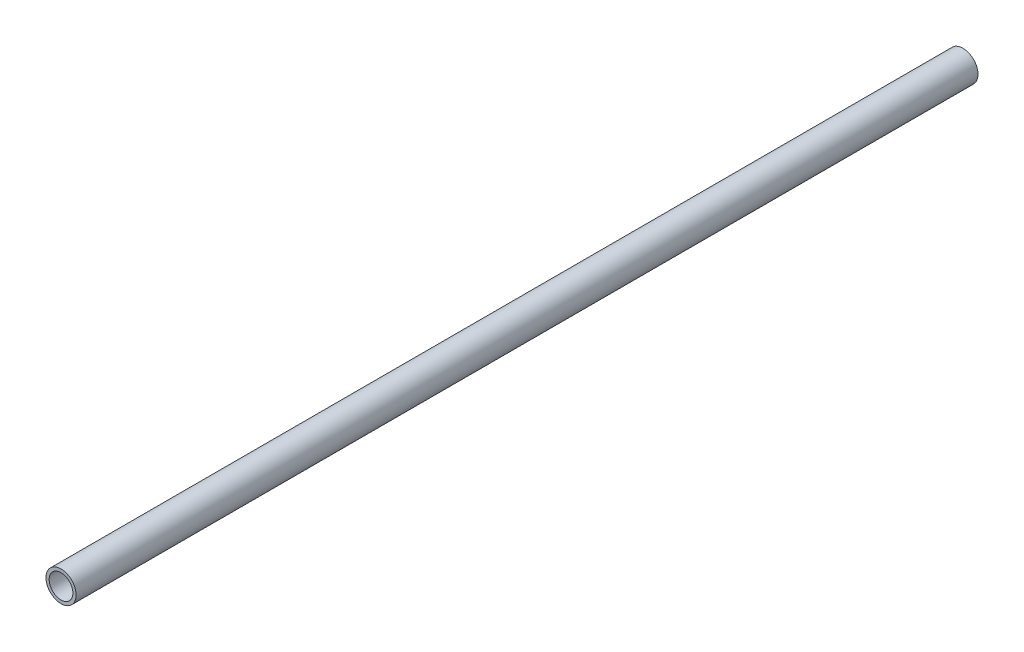
ISO-10303-21;
HEADER;
FILE_DESCRIPTION(('STEP AP214'),'2;1');
FILE_NAME('part.step','',(''),(''),'','','');
FILE_SCHEMA(('AUTOMOTIVE_DESIGN { 1 0 10303 214 1 1 1 1 }'));
ENDSEC;
DATA;
#1=APPLICATION_CONTEXT('core data for automotive mechanical design processes');
#2=APPLICATION_PROTOCOL_DEFINITION('international standard','automotive_design',2000,#1);
#3=PRODUCT_CONTEXT('',#1,'mechanical');
#4=PRODUCT('Part','Part','',(#3));
#5=PRODUCT_RELATED_PRODUCT_CATEGORY('part','',(#4));
#6=PRODUCT_DEFINITION_FORMATION('','',#4);
#7=PRODUCT_DEFINITION_CONTEXT('part definition',#1,'design');
#8=PRODUCT_DEFINITION('design','',#6,#7);
#9=PRODUCT_DEFINITION_SHAPE('','',#8);
#10=(LENGTH_UNIT() NAMED_UNIT(*) SI_UNIT(.MILLI.,.METRE.));
#11=(NAMED_UNIT(*) PLANE_ANGLE_UNIT() SI_UNIT($,.RADIAN.));
#12=(NAMED_UNIT(*) SI_UNIT($,.STERADIAN.) SOLID_ANGLE_UNIT());
#13=UNCERTAINTY_MEASURE_WITH_UNIT(LENGTH_MEASURE(1.E-05),#10,'distance_accuracy_value','');
#14=(GEOMETRIC_REPRESENTATION_CONTEXT(3) GLOBAL_UNCERTAINTY_ASSIGNED_CONTEXT((#13)) GLOBAL_UNIT_ASSIGNED_CONTEXT((#10,
#11,#12)) REPRESENTATION_CONTEXT('',''));
#15=CARTESIAN_POINT('',(0.,0.,0.));
#16=DIRECTION('',(0.,0.,1.));
#17=DIRECTION('',(1.,0.,0.));
#18=AXIS2_PLACEMENT_3D('',#15,#16,#17);
#19=CARTESIAN_POINT('',(0.,0.,380.28));
#20=DIRECTION('',(0.,0.,1.));
#21=DIRECTION('',(1.,0.,0.));
#22=AXIS2_PLACEMENT_3D('',#19,#20,#21);
#23=PLANE('',#22);
#24=CARTESIAN_POINT('',(0.,0.,380.28));
#25=DIRECTION('',(0.,0.,1.));
#26=DIRECTION('',(1.,0.,0.));
#27=AXIS2_PLACEMENT_3D('',#24,#25,#26);
#28=CIRCLE('',#27,6.35);
#29=CARTESIAN_POINT('',(6.35,0.,380.28));
#30=VERTEX_POINT('',#29);
#31=EDGE_CURVE('E10',#30,#30,#28,.T.);
#32=ORIENTED_EDGE('',*,*,#31,.T.);
#33=EDGE_LOOP('',(#32));
#34=FACE_BOUND('',#33,.T.);
#35=CARTESIAN_POINT('',(0.,0.,380.28));
#36=DIRECTION('',(0.,0.,1.));
#37=DIRECTION('',(1.,0.,0.));
#38=AXIS2_PLACEMENT_3D('',#35,#36,#37);
#39=CIRCLE('',#38,5.);
#40=CARTESIAN_POINT('',(5.,0.,380.28));
#41=VERTEX_POINT('',#40);
#42=EDGE_CURVE('E43',#41,#41,#39,.T.);
#43=ORIENTED_EDGE('',*,*,#42,.F.);
#44=EDGE_LOOP('',(#43));
#45=FACE_BOUND('',#44,.T.);
#46=ADVANCED_FACE('F32',(#34,#45),#23,.T.);
#47=CARTESIAN_POINT('',(0.,0.,0.));
#48=DIRECTION('',(0.,0.,1.));
#49=DIRECTION('',(1.,0.,0.));
#50=AXIS2_PLACEMENT_3D('',#47,#48,#49);
#51=PLANE('',#50);
#52=CARTESIAN_POINT('',(0.,0.,0.));
#53=DIRECTION('',(0.,0.,1.));
#54=DIRECTION('',(1.,0.,0.));
#55=AXIS2_PLACEMENT_3D('',#52,#53,#54);
#56=CIRCLE('',#55,6.35);
#57=CARTESIAN_POINT('',(6.35,0.,0.));
#58=VERTEX_POINT('',#57);
#59=EDGE_CURVE('E36',#58,#58,#56,.T.);
#60=ORIENTED_EDGE('',*,*,#59,.F.);
#61=EDGE_LOOP('',(#60));
#62=FACE_BOUND('',#61,.T.);
#63=CARTESIAN_POINT('',(0.,0.,0.));
#64=DIRECTION('',(0.,0.,1.));
#65=DIRECTION('',(1.,0.,0.));
#66=AXIS2_PLACEMENT_3D('',#63,#64,#65);
#67=CIRCLE('',#66,5.);
#68=CARTESIAN_POINT('',(5.,0.,0.));
#69=VERTEX_POINT('',#68);
#70=EDGE_CURVE('E45',#69,#69,#67,.T.);
#71=ORIENTED_EDGE('',*,*,#70,.T.);
#72=EDGE_LOOP('',(#71));
#73=FACE_BOUND('',#72,.T.);
#74=ADVANCED_FACE('F55',(#62,#73),#51,.F.);
#75=CARTESIAN_POINT('',(0.,0.,380.28));
#76=DIRECTION('',(0.,0.,-1.));
#77=DIRECTION('',(-1.,0.,0.));
#78=AXIS2_PLACEMENT_3D('',#75,#76,#77);
#79=CYLINDRICAL_SURFACE('',#78,6.35);
#80=ORIENTED_EDGE('',*,*,#31,.F.);
#81=EDGE_LOOP('',(#80));
#82=FACE_BOUND('',#81,.T.);
#83=ORIENTED_EDGE('',*,*,#59,.T.);
#84=EDGE_LOOP('',(#83));
#85=FACE_BOUND('',#84,.T.);
#86=ADVANCED_FACE('F34',(#82,#85),#79,.T.);
#87=CARTESIAN_POINT('',(0.,0.,380.28));
#88=DIRECTION('',(0.,0.,-1.));
#89=DIRECTION('',(-1.,0.,0.));
#90=AXIS2_PLACEMENT_3D('',#87,#88,#89);
#91=CYLINDRICAL_SURFACE('',#90,5.);
#92=ORIENTED_EDGE('',*,*,#42,.T.);
#93=EDGE_LOOP('',(#92));
#94=FACE_BOUND('',#93,.T.);
#95=ORIENTED_EDGE('',*,*,#70,.F.);
#96=EDGE_LOOP('',(#95));
#97=FACE_BOUND('',#96,.T.);
#98=ADVANCED_FACE('F51',(#94,#97),#91,.F.);
#99=CLOSED_SHELL('',(#46,#74,#86,#98));
#100=MANIFOLD_SOLID_BREP('B2',#99);
#101=ADVANCED_BREP_SHAPE_REPRESENTATION('',(#18,#100),#14);
#102=SHAPE_DEFINITION_REPRESENTATION(#9,#101);
ENDSEC;
END-ISO-10303-21;
